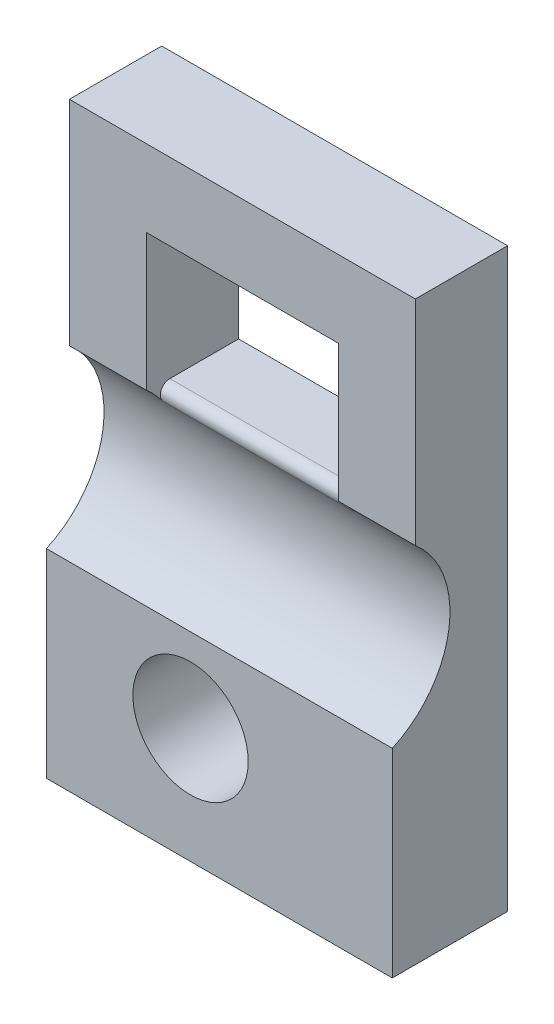
ISO-10303-21;
HEADER;
FILE_DESCRIPTION(('STEP AP214'),'2;1');
FILE_NAME('part.step','',(''),(''),'','','');
FILE_SCHEMA(('AUTOMOTIVE_DESIGN { 1 0 10303 214 1 1 1 1 }'));
ENDSEC;
DATA;
#1=APPLICATION_CONTEXT('core data for automotive mechanical design processes');
#2=APPLICATION_PROTOCOL_DEFINITION('international standard','automotive_design',2000,#1);
#3=PRODUCT_CONTEXT('',#1,'mechanical');
#4=PRODUCT('Part','Part','',(#3));
#5=PRODUCT_RELATED_PRODUCT_CATEGORY('part','',(#4));
#6=PRODUCT_DEFINITION_FORMATION('','',#4);
#7=PRODUCT_DEFINITION_CONTEXT('part definition',#1,'design');
#8=PRODUCT_DEFINITION('design','',#6,#7);
#9=PRODUCT_DEFINITION_SHAPE('','',#8);
#10=(LENGTH_UNIT() NAMED_UNIT(*) SI_UNIT(.MILLI.,.METRE.));
#11=(NAMED_UNIT(*) PLANE_ANGLE_UNIT() SI_UNIT($,.RADIAN.));
#12=(NAMED_UNIT(*) SI_UNIT($,.STERADIAN.) SOLID_ANGLE_UNIT());
#13=UNCERTAINTY_MEASURE_WITH_UNIT(LENGTH_MEASURE(1.E-05),#10,'distance_accuracy_value','');
#14=(GEOMETRIC_REPRESENTATION_CONTEXT(3) GLOBAL_UNCERTAINTY_ASSIGNED_CONTEXT((#13)) GLOBAL_UNIT_ASSIGNED_CONTEXT((#10,
#11,#12)) REPRESENTATION_CONTEXT('',''));
#15=CARTESIAN_POINT('',(0.,0.,0.));
#16=DIRECTION('',(0.,0.,1.));
#17=DIRECTION('',(1.,0.,0.));
#18=AXIS2_PLACEMENT_3D('',#15,#16,#17);
#19=CARTESIAN_POINT('',(0.,30.,6.));
#20=DIRECTION('',(0.,0.,-1.));
#21=DIRECTION('',(-1.,0.,0.));
#22=AXIS2_PLACEMENT_3D('',#19,#20,#21);
#23=PLANE('',#22);
#24=DIRECTION('',(0.,1.,0.));
#25=VECTOR('',#24,1.);
#26=CARTESIAN_POINT('',(18.,0.,6.));
#27=LINE('',#26,#25);
#28=CARTESIAN_POINT('',(18.,0.,6.));
#29=VERTEX_POINT('',#28);
#30=CARTESIAN_POINT('',(18.,10.3524199845511,6.));
#31=VERTEX_POINT('',#30);
#32=EDGE_CURVE('E194',#29,#31,#27,.T.);
#33=ORIENTED_EDGE('',*,*,#32,.T.);
#34=DIRECTION('',(1.,0.,0.));
#35=VECTOR('',#34,1.);
#36=CARTESIAN_POINT('',(0.,10.3524199845511,6.));
#37=LINE('',#36,#35);
#38=CARTESIAN_POINT('',(0.,10.3524199845511,6.));
#39=VERTEX_POINT('',#38);
#40=EDGE_CURVE('E155',#39,#31,#37,.T.);
#41=ORIENTED_EDGE('',*,*,#40,.F.);
#42=DIRECTION('',(0.,-1.,0.));
#43=VECTOR('',#42,1.);
#44=CARTESIAN_POINT('',(0.,0.,6.));
#45=LINE('',#44,#43);
#46=CARTESIAN_POINT('',(0.,0.,6.));
#47=VERTEX_POINT('',#46);
#48=EDGE_CURVE('E147',#39,#47,#45,.T.);
#49=ORIENTED_EDGE('',*,*,#48,.T.);
#50=DIRECTION('',(1.,0.,0.));
#51=VECTOR('',#50,1.);
#52=CARTESIAN_POINT('',(0.,0.,6.));
#53=LINE('',#52,#51);
#54=EDGE_CURVE('E191',#47,#29,#53,.T.);
#55=ORIENTED_EDGE('',*,*,#54,.T.);
#56=EDGE_LOOP('',(#33,#41,#49,#55));
#57=FACE_BOUND('',#56,.T.);
#58=CARTESIAN_POINT('',(7.5,6.,6.));
#59=DIRECTION('',(0.,0.,1.));
#60=DIRECTION('',(1.,0.,0.));
#61=AXIS2_PLACEMENT_3D('',#58,#59,#60);
#62=CIRCLE('',#61,3.);
#63=CARTESIAN_POINT('',(10.5,6.,6.));
#64=VERTEX_POINT('',#63);
#65=EDGE_CURVE('E164',#64,#64,#62,.T.);
#66=ORIENTED_EDGE('',*,*,#65,.F.);
#67=EDGE_LOOP('',(#66));
#68=FACE_BOUND('',#67,.T.);
#69=ADVANCED_FACE('F37',(#57,#68),#23,.F.);
#70=CARTESIAN_POINT('',(0.,30.,0.));
#71=DIRECTION('',(0.,0.,-1.));
#72=DIRECTION('',(-1.,0.,0.));
#73=AXIS2_PLACEMENT_3D('',#70,#71,#72);
#74=PLANE('',#73);
#75=DIRECTION('',(-1.,0.,0.));
#76=VECTOR('',#75,1.);
#77=CARTESIAN_POINT('',(4.,26.,0.));
#78=LINE('',#77,#76);
#79=CARTESIAN_POINT('',(14.,26.,0.));
#80=VERTEX_POINT('',#79);
#81=CARTESIAN_POINT('',(4.,26.,0.));
#82=VERTEX_POINT('',#81);
#83=EDGE_CURVE('E178',#80,#82,#78,.T.);
#84=ORIENTED_EDGE('',*,*,#83,.T.);
#85=DIRECTION('',(0.,-1.,0.));
#86=VECTOR('',#85,1.);
#87=CARTESIAN_POINT('',(4.,26.,0.));
#88=LINE('',#87,#86);
#89=CARTESIAN_POINT('',(4.,18.8,0.));
#90=VERTEX_POINT('',#89);
#91=EDGE_CURVE('E167',#82,#90,#88,.T.);
#92=ORIENTED_EDGE('',*,*,#91,.T.);
#93=DIRECTION('',(1.,0.,0.));
#94=VECTOR('',#93,1.);
#95=CARTESIAN_POINT('',(4.,18.8,0.));
#96=LINE('',#95,#94);
#97=CARTESIAN_POINT('',(14.,18.8,0.));
#98=VERTEX_POINT('',#97);
#99=EDGE_CURVE('E172',#90,#98,#96,.T.);
#100=ORIENTED_EDGE('',*,*,#99,.T.);
#101=DIRECTION('',(0.,1.,0.));
#102=VECTOR('',#101,1.);
#103=CARTESIAN_POINT('',(14.,26.,0.));
#104=LINE('',#103,#102);
#105=EDGE_CURVE('E175',#98,#80,#104,.T.);
#106=ORIENTED_EDGE('',*,*,#105,.T.);
#107=EDGE_LOOP('',(#84,#92,#100,#106));
#108=FACE_BOUND('',#107,.T.);
#109=DIRECTION('',(0.,-1.,0.));
#110=VECTOR('',#109,1.);
#111=CARTESIAN_POINT('',(0.,0.,0.));
#112=LINE('',#111,#110);
#113=CARTESIAN_POINT('',(0.,30.,0.));
#114=VERTEX_POINT('',#113);
#115=CARTESIAN_POINT('',(0.,0.,0.));
#116=VERTEX_POINT('',#115);
#117=EDGE_CURVE('E189',#114,#116,#112,.T.);
#118=ORIENTED_EDGE('',*,*,#117,.F.);
#119=DIRECTION('',(-1.,0.,0.));
#120=VECTOR('',#119,1.);
#121=CARTESIAN_POINT('',(0.,30.,0.));
#122=LINE('',#121,#120);
#123=CARTESIAN_POINT('',(18.,30.,0.));
#124=VERTEX_POINT('',#123);
#125=EDGE_CURVE('E192',#124,#114,#122,.T.);
#126=ORIENTED_EDGE('',*,*,#125,.F.);
#127=DIRECTION('',(0.,1.,0.));
#128=VECTOR('',#127,1.);
#129=CARTESIAN_POINT('',(18.,0.,0.));
#130=LINE('',#129,#128);
#131=CARTESIAN_POINT('',(18.,0.,0.));
#132=VERTEX_POINT('',#131);
#133=EDGE_CURVE('E202',#132,#124,#130,.T.);
#134=ORIENTED_EDGE('',*,*,#133,.F.);
#135=DIRECTION('',(1.,0.,0.));
#136=VECTOR('',#135,1.);
#137=CARTESIAN_POINT('',(0.,0.,0.));
#138=LINE('',#137,#136);
#139=EDGE_CURVE('E200',#116,#132,#138,.T.);
#140=ORIENTED_EDGE('',*,*,#139,.F.);
#141=EDGE_LOOP('',(#118,#126,#134,#140));
#142=FACE_BOUND('',#141,.T.);
#143=CARTESIAN_POINT('',(7.5,6.,0.));
#144=DIRECTION('',(0.,0.,1.));
#145=DIRECTION('',(1.,0.,0.));
#146=AXIS2_PLACEMENT_3D('',#143,#144,#145);
#147=CIRCLE('',#146,3.);
#148=CARTESIAN_POINT('',(10.5,6.,0.));
#149=VERTEX_POINT('',#148);
#150=EDGE_CURVE('E163',#149,#149,#147,.T.);
#151=ORIENTED_EDGE('',*,*,#150,.T.);
#152=EDGE_LOOP('',(#151));
#153=FACE_BOUND('',#152,.T.);
#154=ADVANCED_FACE('F235',(#108,#142,#153),#74,.T.);
#155=CARTESIAN_POINT('',(0.,0.,6.));
#156=DIRECTION('',(1.,0.,0.));
#157=DIRECTION('',(0.,0.,-1.));
#158=AXIS2_PLACEMENT_3D('',#155,#156,#157);
#159=PLANE('',#158);
#160=ORIENTED_EDGE('',*,*,#48,.F.);
#161=CARTESIAN_POINT('',(0.,15.,8.1));
#162=DIRECTION('',(1.,0.,0.));
#163=DIRECTION('',(0.,0.,-1.));
#164=AXIS2_PLACEMENT_3D('',#161,#162,#163);
#165=CIRCLE('',#164,5.1);
#166=CARTESIAN_POINT('',(0.,18.8884444190447,4.8));
#167=VERTEX_POINT('',#166);
#168=EDGE_CURVE('E129',#39,#167,#165,.T.);
#169=ORIENTED_EDGE('',*,*,#168,.T.);
#170=DIRECTION('',(0.,1.,0.));
#171=VECTOR('',#170,1.);
#172=CARTESIAN_POINT('',(0.,18.8884444190447,4.8));
#173=LINE('',#172,#171);
#174=CARTESIAN_POINT('',(0.,30.,4.8));
#175=VERTEX_POINT('',#174);
#176=EDGE_CURVE('E138',#167,#175,#173,.T.);
#177=ORIENTED_EDGE('',*,*,#176,.T.);
#178=DIRECTION('',(0.,0.,-1.));
#179=VECTOR('',#178,1.);
#180=CARTESIAN_POINT('',(0.,30.,6.));
#181=LINE('',#180,#179);
#182=EDGE_CURVE('E197',#175,#114,#181,.T.);
#183=ORIENTED_EDGE('',*,*,#182,.T.);
#184=ORIENTED_EDGE('',*,*,#117,.T.);
#185=DIRECTION('',(0.,0.,-1.));
#186=VECTOR('',#185,1.);
#187=CARTESIAN_POINT('',(0.,0.,6.));
#188=LINE('',#187,#186);
#189=EDGE_CURVE('E213',#47,#116,#188,.T.);
#190=ORIENTED_EDGE('',*,*,#189,.F.);
#191=EDGE_LOOP('',(#160,#169,#177,#183,#184,#190));
#192=FACE_BOUND('',#191,.T.);
#193=ADVANCED_FACE('F145',(#192),#159,.F.);
#194=CARTESIAN_POINT('',(0.,0.,6.));
#195=DIRECTION('',(0.,1.,0.));
#196=DIRECTION('',(0.,0.,1.));
#197=AXIS2_PLACEMENT_3D('',#194,#195,#196);
#198=PLANE('',#197);
#199=ORIENTED_EDGE('',*,*,#139,.T.);
#200=DIRECTION('',(0.,0.,-1.));
#201=VECTOR('',#200,1.);
#202=CARTESIAN_POINT('',(18.,0.,6.));
#203=LINE('',#202,#201);
#204=EDGE_CURVE('E210',#29,#132,#203,.T.);
#205=ORIENTED_EDGE('',*,*,#204,.F.);
#206=ORIENTED_EDGE('',*,*,#54,.F.);
#207=ORIENTED_EDGE('',*,*,#189,.T.);
#208=EDGE_LOOP('',(#199,#205,#206,#207));
#209=FACE_BOUND('',#208,.T.);
#210=ADVANCED_FACE('F259',(#209),#198,.F.);
#211=CARTESIAN_POINT('',(18.,0.,6.));
#212=DIRECTION('',(-1.,0.,0.));
#213=DIRECTION('',(0.,0.,1.));
#214=AXIS2_PLACEMENT_3D('',#211,#212,#213);
#215=PLANE('',#214);
#216=DIRECTION('',(0.,1.,0.));
#217=VECTOR('',#216,1.);
#218=CARTESIAN_POINT('',(18.,18.8884444190447,4.8));
#219=LINE('',#218,#217);
#220=CARTESIAN_POINT('',(18.,18.8884444190447,4.8));
#221=VERTEX_POINT('',#220);
#222=CARTESIAN_POINT('',(18.,30.,4.8));
#223=VERTEX_POINT('',#222);
#224=EDGE_CURVE('E148',#221,#223,#219,.T.);
#225=ORIENTED_EDGE('',*,*,#224,.F.);
#226=CARTESIAN_POINT('',(18.,15.,8.1));
#227=DIRECTION('',(1.,0.,0.));
#228=DIRECTION('',(0.,0.,-1.));
#229=AXIS2_PLACEMENT_3D('',#226,#227,#228);
#230=CIRCLE('',#229,5.1);
#231=EDGE_CURVE('E150',#31,#221,#230,.T.);
#232=ORIENTED_EDGE('',*,*,#231,.F.);
#233=ORIENTED_EDGE('',*,*,#32,.F.);
#234=ORIENTED_EDGE('',*,*,#204,.T.);
#235=ORIENTED_EDGE('',*,*,#133,.T.);
#236=DIRECTION('',(0.,0.,-1.));
#237=VECTOR('',#236,1.);
#238=CARTESIAN_POINT('',(18.,30.,6.));
#239=LINE('',#238,#237);
#240=EDGE_CURVE('E208',#223,#124,#239,.T.);
#241=ORIENTED_EDGE('',*,*,#240,.F.);
#242=EDGE_LOOP('',(#225,#232,#233,#234,#235,#241));
#243=FACE_BOUND('',#242,.T.);
#244=ADVANCED_FACE('F249',(#243),#215,.F.);
#245=CARTESIAN_POINT('',(0.,30.,6.));
#246=DIRECTION('',(0.,-1.,0.));
#247=DIRECTION('',(0.,0.,-1.));
#248=AXIS2_PLACEMENT_3D('',#245,#246,#247);
#249=PLANE('',#248);
#250=ORIENTED_EDGE('',*,*,#182,.F.);
#251=DIRECTION('',(1.,0.,0.));
#252=VECTOR('',#251,1.);
#253=CARTESIAN_POINT('',(0.,30.,4.8));
#254=LINE('',#253,#252);
#255=EDGE_CURVE('E134',#175,#223,#254,.T.);
#256=ORIENTED_EDGE('',*,*,#255,.T.);
#257=ORIENTED_EDGE('',*,*,#240,.T.);
#258=ORIENTED_EDGE('',*,*,#125,.T.);
#259=EDGE_LOOP('',(#250,#256,#257,#258));
#260=FACE_BOUND('',#259,.T.);
#261=ADVANCED_FACE('F251',(#260),#249,.F.);
#262=CARTESIAN_POINT('',(4.,26.,6.));
#263=DIRECTION('',(1.,0.,0.));
#264=DIRECTION('',(0.,1.,0.));
#265=AXIS2_PLACEMENT_3D('',#262,#263,#264);
#266=PLANE('',#265);
#267=CARTESIAN_POINT('',(4.,15.,8.1));
#268=DIRECTION('',(1.,0.,0.));
#269=DIRECTION('',(0.,1.,0.));
#270=AXIS2_PLACEMENT_3D('',#267,#268,#269);
#271=CIRCLE('',#270,5.1);
#272=CARTESIAN_POINT('',(4.,18.0053571428571,3.97958394772111));
#273=VERTEX_POINT('',#272);
#274=CARTESIAN_POINT('',(4.,18.8884444190447,4.8));
#275=VERTEX_POINT('',#274);
#276=EDGE_CURVE('E131',#273,#275,#271,.T.);
#277=ORIENTED_EDGE('',*,*,#276,.F.);
#278=CARTESIAN_POINT('',(4.,18.3,3.57562158965455));
#279=DIRECTION('',(1.,0.,0.));
#280=DIRECTION('',(0.,1.,0.));
#281=AXIS2_PLACEMENT_3D('',#278,#279,#280);
#282=CIRCLE('',#281,0.5);
#283=CARTESIAN_POINT('',(4.,18.8,3.57562158965455));
#284=VERTEX_POINT('',#283);
#285=EDGE_CURVE('E45',#273,#284,#282,.F.);
#286=ORIENTED_EDGE('',*,*,#285,.T.);
#287=DIRECTION('',(0.,0.,-1.));
#288=VECTOR('',#287,1.);
#289=CARTESIAN_POINT('',(4.,18.8,6.));
#290=LINE('',#289,#288);
#291=EDGE_CURVE('E187',#284,#90,#290,.T.);
#292=ORIENTED_EDGE('',*,*,#291,.T.);
#293=ORIENTED_EDGE('',*,*,#91,.F.);
#294=DIRECTION('',(0.,0.,-1.));
#295=VECTOR('',#294,1.);
#296=CARTESIAN_POINT('',(4.,26.,6.));
#297=LINE('',#296,#295);
#298=CARTESIAN_POINT('',(4.,26.,4.8));
#299=VERTEX_POINT('',#298);
#300=EDGE_CURVE('E181',#299,#82,#297,.T.);
#301=ORIENTED_EDGE('',*,*,#300,.F.);
#302=DIRECTION('',(0.,1.,0.));
#303=VECTOR('',#302,1.);
#304=CARTESIAN_POINT('',(4.,26.,4.8));
#305=LINE('',#304,#303);
#306=EDGE_CURVE('E160',#275,#299,#305,.T.);
#307=ORIENTED_EDGE('',*,*,#306,.F.);
#308=EDGE_LOOP('',(#277,#286,#292,#293,#301,#307));
#309=FACE_BOUND('',#308,.T.);
#310=ADVANCED_FACE('F239',(#309),#266,.T.);
#311=CARTESIAN_POINT('',(4.,18.8,6.));
#312=DIRECTION('',(0.,1.,0.));
#313=DIRECTION('',(0.,0.,1.));
#314=AXIS2_PLACEMENT_3D('',#311,#312,#313);
#315=PLANE('',#314);
#316=ORIENTED_EDGE('',*,*,#291,.F.);
#317=DIRECTION('',(-1.,0.,0.));
#318=VECTOR('',#317,1.);
#319=CARTESIAN_POINT('',(14.,18.8,3.57562158965455));
#320=LINE('',#319,#318);
#321=CARTESIAN_POINT('',(14.,18.8,3.57562158965455));
#322=VERTEX_POINT('',#321);
#323=EDGE_CURVE('E58',#284,#322,#320,.F.);
#324=ORIENTED_EDGE('',*,*,#323,.T.);
#325=DIRECTION('',(0.,0.,-1.));
#326=VECTOR('',#325,1.);
#327=CARTESIAN_POINT('',(14.,18.8,6.));
#328=LINE('',#327,#326);
#329=EDGE_CURVE('E185',#322,#98,#328,.T.);
#330=ORIENTED_EDGE('',*,*,#329,.T.);
#331=ORIENTED_EDGE('',*,*,#99,.F.);
#332=EDGE_LOOP('',(#316,#324,#330,#331));
#333=FACE_BOUND('',#332,.T.);
#334=ADVANCED_FACE('F232',(#333),#315,.T.);
#335=CARTESIAN_POINT('',(14.,26.,6.));
#336=DIRECTION('',(-1.,0.,0.));
#337=DIRECTION('',(0.,-1.,0.));
#338=AXIS2_PLACEMENT_3D('',#335,#336,#337);
#339=PLANE('',#338);
#340=CARTESIAN_POINT('',(14.,15.,8.1));
#341=DIRECTION('',(-1.,0.,0.));
#342=DIRECTION('',(0.,-1.,0.));
#343=AXIS2_PLACEMENT_3D('',#340,#341,#342);
#344=CIRCLE('',#343,5.1);
#345=CARTESIAN_POINT('',(14.,18.8884444190447,4.8));
#346=VERTEX_POINT('',#345);
#347=CARTESIAN_POINT('',(14.,18.0053571428571,3.97958394772111));
#348=VERTEX_POINT('',#347);
#349=EDGE_CURVE('E218',#346,#348,#344,.T.);
#350=ORIENTED_EDGE('',*,*,#349,.F.);
#351=DIRECTION('',(0.,-1.,0.));
#352=VECTOR('',#351,1.);
#353=CARTESIAN_POINT('',(14.,26.,4.8));
#354=LINE('',#353,#352);
#355=CARTESIAN_POINT('',(14.,26.,4.8));
#356=VERTEX_POINT('',#355);
#357=EDGE_CURVE('E157',#356,#346,#354,.T.);
#358=ORIENTED_EDGE('',*,*,#357,.F.);
#359=DIRECTION('',(0.,0.,-1.));
#360=VECTOR('',#359,1.);
#361=CARTESIAN_POINT('',(14.,26.,6.));
#362=LINE('',#361,#360);
#363=EDGE_CURVE('E183',#356,#80,#362,.T.);
#364=ORIENTED_EDGE('',*,*,#363,.T.);
#365=ORIENTED_EDGE('',*,*,#105,.F.);
#366=ORIENTED_EDGE('',*,*,#329,.F.);
#367=CARTESIAN_POINT('',(14.,18.3,3.57562158965455));
#368=DIRECTION('',(-1.,0.,0.));
#369=DIRECTION('',(0.,-1.,0.));
#370=AXIS2_PLACEMENT_3D('',#367,#368,#369);
#371=CIRCLE('',#370,0.5);
#372=EDGE_CURVE('E11',#322,#348,#371,.F.);
#373=ORIENTED_EDGE('',*,*,#372,.T.);
#374=EDGE_LOOP('',(#350,#358,#364,#365,#366,#373));
#375=FACE_BOUND('',#374,.T.);
#376=ADVANCED_FACE('F228',(#375),#339,.T.);
#377=CARTESIAN_POINT('',(4.,26.,6.));
#378=DIRECTION('',(0.,-1.,0.));
#379=DIRECTION('',(0.,0.,-1.));
#380=AXIS2_PLACEMENT_3D('',#377,#378,#379);
#381=PLANE('',#380);
#382=DIRECTION('',(1.,0.,0.));
#383=VECTOR('',#382,1.);
#384=CARTESIAN_POINT('',(4.,26.,4.8));
#385=LINE('',#384,#383);
#386=EDGE_CURVE('E216',#299,#356,#385,.T.);
#387=ORIENTED_EDGE('',*,*,#386,.F.);
#388=ORIENTED_EDGE('',*,*,#300,.T.);
#389=ORIENTED_EDGE('',*,*,#83,.F.);
#390=ORIENTED_EDGE('',*,*,#363,.F.);
#391=EDGE_LOOP('',(#387,#388,#389,#390));
#392=FACE_BOUND('',#391,.T.);
#393=ADVANCED_FACE('F242',(#392),#381,.T.);
#394=CARTESIAN_POINT('',(7.5,6.,6.));
#395=DIRECTION('',(0.,0.,-1.));
#396=DIRECTION('',(-1.,0.,0.));
#397=AXIS2_PLACEMENT_3D('',#394,#395,#396);
#398=CYLINDRICAL_SURFACE('',#397,3.);
#399=ORIENTED_EDGE('',*,*,#65,.T.);
#400=EDGE_LOOP('',(#399));
#401=FACE_BOUND('',#400,.T.);
#402=ORIENTED_EDGE('',*,*,#150,.F.);
#403=EDGE_LOOP('',(#402));
#404=FACE_BOUND('',#403,.T.);
#405=ADVANCED_FACE('F266',(#401,#404),#398,.F.);
#406=CARTESIAN_POINT('',(0.,15.,8.1));
#407=DIRECTION('',(1.,0.,0.));
#408=DIRECTION('',(0.,0.,-1.));
#409=AXIS2_PLACEMENT_3D('',#406,#407,#408);
#410=CYLINDRICAL_SURFACE('',#409,5.1);
#411=DIRECTION('',(1.,0.,0.));
#412=VECTOR('',#411,1.);
#413=CARTESIAN_POINT('',(0.,18.0053571428571,3.97958394772111));
#414=LINE('',#413,#412);
#415=EDGE_CURVE('E220',#348,#273,#414,.F.);
#416=ORIENTED_EDGE('',*,*,#415,.T.);
#417=ORIENTED_EDGE('',*,*,#276,.T.);
#418=DIRECTION('',(1.,0.,0.));
#419=VECTOR('',#418,1.);
#420=CARTESIAN_POINT('',(0.,18.8884444190447,4.8));
#421=LINE('',#420,#419);
#422=EDGE_CURVE('E124',#167,#275,#421,.T.);
#423=ORIENTED_EDGE('',*,*,#422,.F.);
#424=ORIENTED_EDGE('',*,*,#168,.F.);
#425=ORIENTED_EDGE('',*,*,#40,.T.);
#426=ORIENTED_EDGE('',*,*,#231,.T.);
#427=EDGE_CURVE('E135',#346,#221,#421,.T.);
#428=ORIENTED_EDGE('',*,*,#427,.F.);
#429=ORIENTED_EDGE('',*,*,#349,.T.);
#430=EDGE_LOOP('',(#416,#417,#423,#424,#425,#426,#428,#429));
#431=FACE_BOUND('',#430,.T.);
#432=ADVANCED_FACE('F127',(#431),#410,.F.);
#433=CARTESIAN_POINT('',(0.,18.8884444190447,4.8));
#434=DIRECTION('',(0.,0.,-1.));
#435=DIRECTION('',(-1.,0.,0.));
#436=AXIS2_PLACEMENT_3D('',#433,#434,#435);
#437=PLANE('',#436);
#438=ORIENTED_EDGE('',*,*,#306,.T.);
#439=ORIENTED_EDGE('',*,*,#386,.T.);
#440=ORIENTED_EDGE('',*,*,#357,.T.);
#441=ORIENTED_EDGE('',*,*,#427,.T.);
#442=ORIENTED_EDGE('',*,*,#224,.T.);
#443=ORIENTED_EDGE('',*,*,#255,.F.);
#444=ORIENTED_EDGE('',*,*,#176,.F.);
#445=ORIENTED_EDGE('',*,*,#422,.T.);
#446=EDGE_LOOP('',(#438,#439,#440,#441,#442,#443,#444,#445));
#447=FACE_BOUND('',#446,.T.);
#448=ADVANCED_FACE('F139',(#447),#437,.F.);
#449=CARTESIAN_POINT('',(0.,18.3,3.57562158965455));
#450=DIRECTION('',(1.,0.,0.));
#451=DIRECTION('',(0.,0.,-1.));
#452=AXIS2_PLACEMENT_3D('',#449,#450,#451);
#453=CYLINDRICAL_SURFACE('',#452,0.5);
#454=ORIENTED_EDGE('',*,*,#372,.F.);
#455=ORIENTED_EDGE('',*,*,#323,.F.);
#456=ORIENTED_EDGE('',*,*,#285,.F.);
#457=ORIENTED_EDGE('',*,*,#415,.F.);
#458=EDGE_LOOP('',(#454,#455,#456,#457));
#459=FACE_BOUND('',#458,.T.);
#460=ADVANCED_FACE('F39',(#459),#453,.T.);
#461=CLOSED_SHELL('',(#69,#154,#193,#210,#244,#261,#310,#334,#376,#393,#405,#432,#448,#460));
#462=MANIFOLD_SOLID_BREP('B2',#461);
#463=ADVANCED_BREP_SHAPE_REPRESENTATION('',(#18,#462),#14);
#464=SHAPE_DEFINITION_REPRESENTATION(#9,#463);
ENDSEC;
END-ISO-10303-21;
